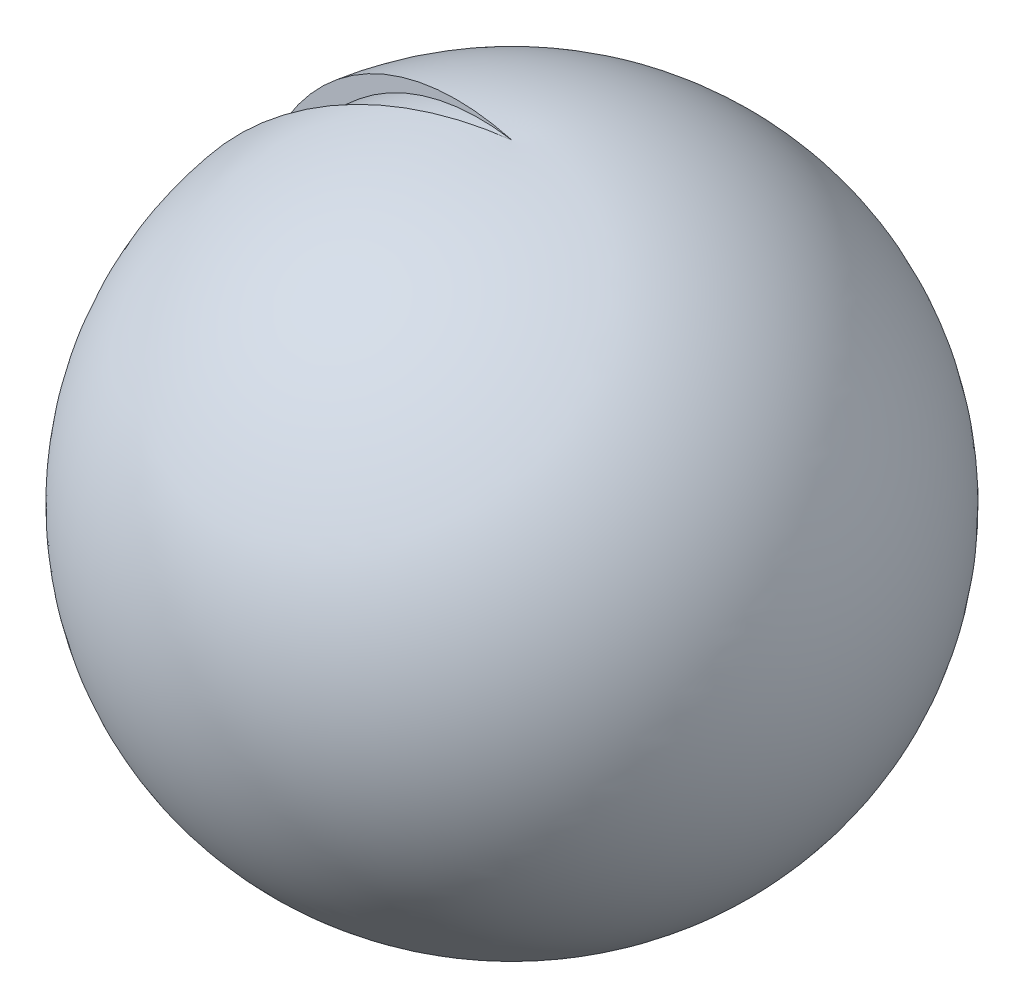
ISO-10303-21;
HEADER;
FILE_DESCRIPTION(('STEP AP214'),'2;1');
FILE_NAME('part.step','',(''),(''),'','','');
FILE_SCHEMA(('AUTOMOTIVE_DESIGN { 1 0 10303 214 1 1 1 1 }'));
ENDSEC;
DATA;
#1=APPLICATION_CONTEXT('core data for automotive mechanical design processes');
#2=APPLICATION_PROTOCOL_DEFINITION('international standard','automotive_design',2000,#1);
#3=PRODUCT_CONTEXT('',#1,'mechanical');
#4=PRODUCT('Part','Part','',(#3));
#5=PRODUCT_RELATED_PRODUCT_CATEGORY('part','',(#4));
#6=PRODUCT_DEFINITION_FORMATION('','',#4);
#7=PRODUCT_DEFINITION_CONTEXT('part definition',#1,'design');
#8=PRODUCT_DEFINITION('design','',#6,#7);
#9=PRODUCT_DEFINITION_SHAPE('','',#8);
#10=(LENGTH_UNIT() NAMED_UNIT(*) SI_UNIT(.MILLI.,.METRE.));
#11=(NAMED_UNIT(*) PLANE_ANGLE_UNIT() SI_UNIT($,.RADIAN.));
#12=(NAMED_UNIT(*) SI_UNIT($,.STERADIAN.) SOLID_ANGLE_UNIT());
#13=UNCERTAINTY_MEASURE_WITH_UNIT(LENGTH_MEASURE(1.E-05),#10,'distance_accuracy_value','');
#14=(GEOMETRIC_REPRESENTATION_CONTEXT(3) GLOBAL_UNCERTAINTY_ASSIGNED_CONTEXT((#13)) GLOBAL_UNIT_ASSIGNED_CONTEXT((#10,
#11,#12)) REPRESENTATION_CONTEXT('',''));
#15=CARTESIAN_POINT('',(0.,0.,0.));
#16=DIRECTION('',(0.,0.,1.));
#17=DIRECTION('',(1.,0.,0.));
#18=AXIS2_PLACEMENT_3D('',#15,#16,#17);
#19=CARTESIAN_POINT('',(0.,316.757357555114,40.001853342897));
#20=DIRECTION('',(-1.,0.,0.));
#21=DIRECTION('',(0.,0.,-1.));
#22=AXIS2_PLACEMENT_3D('',#19,#20,#21);
#23=CIRCLE('',#22,886.815172660816);
#24=TRIMMED_CURVE('',#23,(PARAMETER_VALUE(-1.52567369909589)),
(PARAMETER_VALUE(1.52567369909589)),.T.,.PARAMETER.);
#25=CARTESIAN_POINT('',(0.,316.757357555114,0.));
#26=DIRECTION('',(0.,-1.,0.));
#27=AXIS1_PLACEMENT('',#25,#26);
#28=SURFACE_OF_REVOLUTION('',#24,#27);
#29=CARTESIAN_POINT('',(0.,691.536604846044,0.));
#30=DIRECTION('',(0.,-1.,0.));
#31=DIRECTION('',(0.,0.,-1.));
#32=AXIS2_PLACEMENT_3D('',#29,#30,#31);
#33=CIRCLE('',#32,763.727993223396);
#34=CARTESIAN_POINT('',(-752.125248918855,691.536604846044,132.619974256465));
#35=VERTEX_POINT('',#34);
#36=CARTESIAN_POINT('',(-752.125248918855,691.536604846044,-132.619974256465));
#37=VERTEX_POINT('',#36);
#38=EDGE_CURVE('E12',#35,#37,#33,.T.);
#39=ORIENTED_EDGE('',*,*,#38,.F.);
#40=CARTESIAN_POINT('',(39.3941353069422,316.757357555114,-6.94624893629388));
#41=DIRECTION('',(0.173648177666931,0.,0.984807753012208));
#42=DIRECTION('',(0.984807753012208,0.,-0.173648177666931));
#43=AXIS2_PLACEMENT_3D('',#40,#41,#42);
#44=CIRCLE('',#43,886.815172660816);
#45=CARTESIAN_POINT('',(0.,1202.66988268983,0.));
#46=VERTEX_POINT('',#45);
#47=EDGE_CURVE('E98',#46,#35,#44,.T.);
#48=ORIENTED_EDGE('',*,*,#47,.F.);
#49=CARTESIAN_POINT('',(39.3941353069422,316.757357555114,6.94624893629388));
#50=DIRECTION('',(-0.173648177666931,0.,0.984807753012208));
#51=DIRECTION('',(0.984807753012208,0.,0.173648177666931));
#52=AXIS2_PLACEMENT_3D('',#49,#50,#51);
#53=CIRCLE('',#52,886.815172660816);
#54=EDGE_CURVE('E66',#46,#37,#53,.T.);
#55=ORIENTED_EDGE('',*,*,#54,.T.);
#56=EDGE_LOOP('',(#39,#48,#55));
#57=FACE_BOUND('',#56,.T.);
#58=ADVANCED_FACE('F51',(#57),#28,.T.);
#59=CARTESIAN_POINT('',(0.,504.820269803941,0.));
#60=DIRECTION('',(0.,-1.,0.));
#61=DIRECTION('',(0.,0.,-1.));
#62=AXIS2_PLACEMENT_3D('',#59,#60,#61);
#63=DEGENERATE_TOROIDAL_SURFACE('',#62,363.306965646286,441.814428349125,.T.);
#64=CARTESIAN_POINT('',(0.,69.4601548929694,0.));
#65=DIRECTION('',(0.,-1.,0.));
#66=DIRECTION('',(0.,0.,-1.));
#67=AXIS2_PLACEMENT_3D('',#64,#65,#66);
#68=CIRCLE('',#67,438.550300515028);
#69=CARTESIAN_POINT('',(-431.887736033033,69.4601548929694,76.1534604997194));
#70=VERTEX_POINT('',#69);
#71=CARTESIAN_POINT('',(-431.887736033033,69.4601548929694,-76.1534604997194));
#72=VERTEX_POINT('',#71);
#73=EDGE_CURVE('E59',#70,#72,#68,.T.);
#74=ORIENTED_EDGE('',*,*,#73,.F.);
#75=CARTESIAN_POINT('',(-357.787516491802,504.820269803941,63.0875925181797));
#76=DIRECTION('',(0.173648177666931,0.,0.984807753012208));
#77=DIRECTION('',(0.984807753012208,0.,-0.173648177666931));
#78=AXIS2_PLACEMENT_3D('',#75,#76,#77);
#79=CIRCLE('',#78,441.814428349125);
#80=EDGE_CURVE('E95',#35,#70,#79,.T.);
#81=ORIENTED_EDGE('',*,*,#80,.F.);
#82=ORIENTED_EDGE('',*,*,#38,.T.);
#83=CARTESIAN_POINT('',(-357.787516491802,504.820269803941,-63.0875925181797));
#84=DIRECTION('',(-0.173648177666931,0.,0.984807753012208));
#85=DIRECTION('',(0.984807753012208,0.,0.173648177666931));
#86=AXIS2_PLACEMENT_3D('',#83,#84,#85);
#87=CIRCLE('',#86,441.814428349125);
#88=EDGE_CURVE('E92',#37,#72,#87,.T.);
#89=ORIENTED_EDGE('',*,*,#88,.T.);
#90=EDGE_LOOP('',(#74,#81,#82,#89));
#91=FACE_BOUND('',#90,.T.);
#92=ADVANCED_FACE('F53',(#91),#63,.T.);
#93=CARTESIAN_POINT('',(0.,316.755144769097,0.));
#94=DIRECTION('',(0.,-1.,0.));
#95=DIRECTION('',(0.,0.,-1.));
#96=AXIS2_PLACEMENT_3D('',#93,#94,#95);
#97=DEGENERATE_TOROIDAL_SURFACE('',#96,40.0000005549732,538.669845705161,.F.);
#98=CARTESIAN_POINT('',(0.,842.30410325337,0.));
#99=DIRECTION('',(0.,-1.,0.));
#100=DIRECTION('',(0.,0.,-1.));
#101=AXIS2_PLACEMENT_3D('',#98,#99,#100);
#102=CIRCLE('',#101,78.167232247179);
#103=CARTESIAN_POINT('',(-76.9796963485277,842.30410325337,13.5735974329904));
#104=VERTEX_POINT('',#103);
#105=CARTESIAN_POINT('',(-76.9796963485277,842.30410325337,-13.5735974329904));
#106=VERTEX_POINT('',#105);
#107=EDGE_CURVE('E117',#104,#106,#102,.T.);
#108=ORIENTED_EDGE('',*,*,#107,.F.);
#109=CARTESIAN_POINT('',(39.3923106670302,316.755144769097,-6.94592720304732));
#110=DIRECTION('',(-0.173648177666931,0.,-0.984807753012208));
#111=DIRECTION('',(0.984807753012208,0.,-0.173648177666931));
#112=AXIS2_PLACEMENT_3D('',#109,#110,#111);
#113=CIRCLE('',#112,538.669845705161);
#114=EDGE_CURVE('E110',#70,#104,#113,.T.);
#115=ORIENTED_EDGE('',*,*,#114,.F.);
#116=ORIENTED_EDGE('',*,*,#73,.T.);
#117=CARTESIAN_POINT('',(39.3923106670303,316.755144769097,6.94592720304732));
#118=DIRECTION('',(0.173648177666931,0.,-0.984807753012208));
#119=DIRECTION('',(0.984807753012208,0.,0.173648177666931));
#120=AXIS2_PLACEMENT_3D('',#117,#118,#119);
#121=CIRCLE('',#120,538.669845705161);
#122=EDGE_CURVE('E102',#72,#106,#121,.T.);
#123=ORIENTED_EDGE('',*,*,#122,.T.);
#124=EDGE_LOOP('',(#108,#115,#116,#123));
#125=FACE_BOUND('',#124,.T.);
#126=ADVANCED_FACE('F120',(#125),#97,.T.);
#127=CARTESIAN_POINT('',(0.,504.82028321714,-363.306952930245));
#128=DIRECTION('',(-1.,0.,0.));
#129=DIRECTION('',(0.,0.,-1.));
#130=AXIS2_PLACEMENT_3D('',#127,#128,#129);
#131=CIRCLE('',#130,441.814428349125);
#132=TRIMMED_CURVE('',#131,(PARAMETER_VALUE(-2.53624914352901)),
(PARAMETER_VALUE(2.53624914352901)),.T.,.PARAMETER.);
#133=CARTESIAN_POINT('',(0.,504.82028321714,0.));
#134=DIRECTION('',(0.,-1.,0.));
#135=AXIS1_PLACEMENT('',#133,#134);
#136=SURFACE_OF_REVOLUTION('',#132,#135);
#137=CARTESIAN_POINT('',(-357.787503968946,504.82028321714,-63.0875903100624));
#138=DIRECTION('',(0.173648177666931,0.,-0.984807753012208));
#139=DIRECTION('',(0.984807753012208,0.,0.173648177666931));
#140=AXIS2_PLACEMENT_3D('',#137,#138,#139);
#141=CIRCLE('',#140,441.814428349125);
#142=CARTESIAN_POINT('',(0.,756.232389230364,0.));
#143=VERTEX_POINT('',#142);
#144=EDGE_CURVE('E104',#106,#143,#141,.T.);
#145=ORIENTED_EDGE('',*,*,#144,.T.);
#146=CARTESIAN_POINT('',(-357.787503968946,504.82028321714,63.0875903100624));
#147=DIRECTION('',(-0.173648177666931,0.,-0.984807753012208));
#148=DIRECTION('',(0.984807753012208,0.,-0.173648177666931));
#149=AXIS2_PLACEMENT_3D('',#146,#147,#148);
#150=CIRCLE('',#149,441.814428349125);
#151=EDGE_CURVE('E113',#104,#143,#150,.T.);
#152=ORIENTED_EDGE('',*,*,#151,.F.);
#153=ORIENTED_EDGE('',*,*,#107,.T.);
#154=EDGE_LOOP('',(#145,#152,#153));
#155=FACE_BOUND('',#154,.T.);
#156=ADVANCED_FACE('F125',(#155),#136,.F.);
#157=CARTESIAN_POINT('',(39.3941353069422,316.757357555114,-6.94624893629388));
#158=DIRECTION('',(0.173648177666931,0.,0.984807753012208));
#159=DIRECTION('',(0.984807753012208,0.,-0.173648177666931));
#160=AXIS2_PLACEMENT_3D('',#157,#158,#159);
#161=PLANE('',#160);
#162=ORIENTED_EDGE('',*,*,#47,.T.);
#163=ORIENTED_EDGE('',*,*,#80,.T.);
#164=ORIENTED_EDGE('',*,*,#114,.T.);
#165=ORIENTED_EDGE('',*,*,#151,.T.);
#166=DIRECTION('',(0.,1.,0.));
#167=VECTOR('',#166,1.);
#168=CARTESIAN_POINT('',(0.,756.232389230364,0.));
#169=LINE('',#168,#167);
#170=EDGE_CURVE('E71',#143,#46,#169,.T.);
#171=ORIENTED_EDGE('',*,*,#170,.T.);
#172=EDGE_LOOP('',(#162,#163,#164,#165,#171));
#173=FACE_BOUND('',#172,.T.);
#174=ADVANCED_FACE('F122',(#173),#161,.T.);
#175=CARTESIAN_POINT('',(39.3941353069422,316.757357555114,6.94624893629388));
#176=DIRECTION('',(-0.173648177666931,0.,0.984807753012208));
#177=DIRECTION('',(0.984807753012208,0.,0.173648177666931));
#178=AXIS2_PLACEMENT_3D('',#175,#176,#177);
#179=PLANE('',#178);
#180=ORIENTED_EDGE('',*,*,#54,.F.);
#181=ORIENTED_EDGE('',*,*,#170,.F.);
#182=ORIENTED_EDGE('',*,*,#144,.F.);
#183=ORIENTED_EDGE('',*,*,#122,.F.);
#184=ORIENTED_EDGE('',*,*,#88,.F.);
#185=EDGE_LOOP('',(#180,#181,#182,#183,#184));
#186=FACE_BOUND('',#185,.T.);
#187=ADVANCED_FACE('F100',(#186),#179,.F.);
#188=CLOSED_SHELL('',(#58,#92,#126,#156,#174,#187));
#189=MANIFOLD_SOLID_BREP('B2',#188);
#190=CARTESIAN_POINT('',(0.,-47.7675103642231,0.));
#191=DIRECTION('',(0.,-1.,0.));
#192=DIRECTION('',(0.,0.,-1.));
#193=AXIS2_PLACEMENT_3D('',#190,#191,#192);
#194=DEGENERATE_TOROIDAL_SURFACE('',#193,295.241511527549,441.814428349125,.T.);
#195=CARTESIAN_POINT('',(0.,-409.680702542864,0.));
#196=DIRECTION('',(0.,-1.,0.));
#197=DIRECTION('',(0.,0.,-1.));
#198=AXIS2_PLACEMENT_3D('',#195,#196,#197);
#199=CIRCLE('',#198,548.655856868395);
#200=CARTESIAN_POINT('',(-540.320541579552,-409.680702542864,-95.2730897114816));
#201=VERTEX_POINT('',#200);
#202=CARTESIAN_POINT('',(-540.320541579552,-409.680702542864,95.2730897114816));
#203=VERTEX_POINT('',#202);
#204=EDGE_CURVE('E49',#201,#203,#199,.T.);
#205=ORIENTED_EDGE('',*,*,#204,.T.);
#206=CARTESIAN_POINT('',(-290.756129563374,-47.7675103642231,51.2681504483871));
#207=DIRECTION('',(-0.173648177666924,0.,-0.984807753012209));
#208=DIRECTION('',(-0.984807753012209,0.,0.173648177666924));
#209=AXIS2_PLACEMENT_3D('',#206,#207,#208);
#210=CIRCLE('',#209,441.814428349125);
#211=CARTESIAN_POINT('',(-138.409002396809,-461.613769335048,24.4052414954991));
#212=VERTEX_POINT('',#211);
#213=EDGE_CURVE('E221',#212,#203,#210,.T.);
#214=ORIENTED_EDGE('',*,*,#213,.F.);
#215=CARTESIAN_POINT('',(0.,-461.613769335048,0.));
#216=DIRECTION('',(0.,-1.,0.));
#217=DIRECTION('',(0.,0.,-1.));
#218=AXIS2_PLACEMENT_3D('',#215,#216,#217);
#219=CIRCLE('',#218,140.544184358278);
#220=CARTESIAN_POINT('',(-138.409002396809,-461.613769335048,-24.4052414954991));
#221=VERTEX_POINT('',#220);
#222=EDGE_CURVE('E190',#221,#212,#219,.T.);
#223=ORIENTED_EDGE('',*,*,#222,.F.);
#224=CARTESIAN_POINT('',(-290.756129563374,-47.7675103642231,-51.2681504483871));
#225=DIRECTION('',(0.173648177666924,0.,-0.984807753012209));
#226=DIRECTION('',(-0.984807753012209,0.,-0.173648177666924));
#227=AXIS2_PLACEMENT_3D('',#224,#225,#226);
#228=CIRCLE('',#227,441.814428349125);
#229=EDGE_CURVE('E223',#221,#201,#228,.T.);
#230=ORIENTED_EDGE('',*,*,#229,.T.);
#231=EDGE_LOOP('',(#205,#214,#223,#230));
#232=FACE_BOUND('',#231,.T.);
#233=ADVANCED_FACE('F175',(#232),#194,.T.);
#234=CARTESIAN_POINT('',(0.,316.757357555114,-40.001853342897));
#235=DIRECTION('',(-1.,0.,0.));
#236=DIRECTION('',(0.,0.,-1.));
#237=AXIS2_PLACEMENT_3D('',#234,#235,#236);
#238=CIRCLE('',#237,886.815172660816);
#239=TRIMMED_CURVE('',#238,(PARAMETER_VALUE(-1.61591895449391)),
(PARAMETER_VALUE(1.61591895449391)),.T.,.PARAMETER.);
#240=CARTESIAN_POINT('',(0.,316.757357555114,0.));
#241=DIRECTION('',(0.,-1.,0.));
#242=AXIS1_PLACEMENT('',#240,#241);
#243=SURFACE_OF_REVOLUTION('',#239,#242);
#244=CARTESIAN_POINT('',(-39.3941353069423,316.757357555114,6.94624893629362));
#245=DIRECTION('',(-0.173648177666924,0.,-0.984807753012209));
#246=DIRECTION('',(-0.984807753012209,0.,0.173648177666924));
#247=AXIS2_PLACEMENT_3D('',#244,#245,#246);
#248=CIRCLE('',#247,886.815172660816);
#249=CARTESIAN_POINT('',(0.,1202.66988268983,0.));
#250=VERTEX_POINT('',#249);
#251=EDGE_CURVE('E232',#203,#250,#248,.T.);
#252=ORIENTED_EDGE('',*,*,#251,.F.);
#253=ORIENTED_EDGE('',*,*,#204,.F.);
#254=CARTESIAN_POINT('',(-39.3941353069423,316.757357555114,-6.94624893629362));
#255=DIRECTION('',(0.173648177666924,0.,-0.984807753012209));
#256=DIRECTION('',(-0.984807753012209,0.,-0.173648177666924));
#257=AXIS2_PLACEMENT_3D('',#254,#255,#256);
#258=CIRCLE('',#257,886.815172660816);
#259=EDGE_CURVE('E236',#201,#250,#258,.T.);
#260=ORIENTED_EDGE('',*,*,#259,.T.);
#261=EDGE_LOOP('',(#252,#253,#260));
#262=FACE_BOUND('',#261,.T.);
#263=ADVANCED_FACE('F177',(#262),#243,.T.);
#264=CARTESIAN_POINT('',(0.,504.82028321714,363.306952930245));
#265=DIRECTION('',(-1.,0.,0.));
#266=DIRECTION('',(0.,0.,-1.));
#267=AXIS2_PLACEMENT_3D('',#264,#265,#266);
#268=CIRCLE('',#267,441.814428349125);
#269=TRIMMED_CURVE('',#268,(PARAMETER_VALUE(-0.60534351006078)),
(PARAMETER_VALUE(0.60534351006078)),.T.,.PARAMETER.);
#270=CARTESIAN_POINT('',(0.,504.82028321714,0.));
#271=DIRECTION('',(0.,-1.,0.));
#272=AXIS1_PLACEMENT('',#270,#271);
#273=SURFACE_OF_REVOLUTION('',#269,#272);
#274=CARTESIAN_POINT('',(0.,506.319533319672,0.));
#275=DIRECTION('',(0.,-1.,0.));
#276=DIRECTION('',(0.,0.,-1.));
#277=AXIS2_PLACEMENT_3D('',#274,#275,#276);
#278=CIRCLE('',#277,78.5049316389618);
#279=CARTESIAN_POINT('',(-77.312265327743,506.319533319672,-13.6322383169722));
#280=VERTEX_POINT('',#279);
#281=CARTESIAN_POINT('',(-77.312265327743,506.319533319672,13.6322383169722));
#282=VERTEX_POINT('',#281);
#283=EDGE_CURVE('E183',#280,#282,#278,.T.);
#284=ORIENTED_EDGE('',*,*,#283,.T.);
#285=CARTESIAN_POINT('',(357.787503968947,504.82028321714,-63.08759031006));
#286=DIRECTION('',(0.173648177666924,0.,0.984807753012209));
#287=DIRECTION('',(-0.984807753012209,0.,0.173648177666924));
#288=AXIS2_PLACEMENT_3D('',#285,#286,#287);
#289=CIRCLE('',#288,441.814428349125);
#290=CARTESIAN_POINT('',(0.,756.232389230364,0.));
#291=VERTEX_POINT('',#290);
#292=EDGE_CURVE('E237',#291,#282,#289,.T.);
#293=ORIENTED_EDGE('',*,*,#292,.F.);
#294=CARTESIAN_POINT('',(357.787503968947,504.82028321714,63.08759031006));
#295=DIRECTION('',(-0.173648177666924,0.,0.984807753012209));
#296=DIRECTION('',(-0.984807753012209,0.,-0.173648177666924));
#297=AXIS2_PLACEMENT_3D('',#294,#295,#296);
#298=CIRCLE('',#297,441.814428349125);
#299=EDGE_CURVE('E249',#291,#280,#298,.T.);
#300=ORIENTED_EDGE('',*,*,#299,.T.);
#301=EDGE_LOOP('',(#284,#293,#300));
#302=FACE_BOUND('',#301,.T.);
#303=ADVANCED_FACE('F259',(#302),#273,.F.);
#304=CARTESIAN_POINT('',(0.,316.755144769097,0.));
#305=DIRECTION('',(0.,-1.,0.));
#306=DIRECTION('',(0.,0.,-1.));
#307=AXIS2_PLACEMENT_3D('',#304,#305,#306);
#308=DEGENERATE_TOROIDAL_SURFACE('',#307,40.0000005549732,193.435485690542,.T.);
#309=CARTESIAN_POINT('',(0.,151.503354377394,0.));
#310=DIRECTION('',(0.,-1.,0.));
#311=DIRECTION('',(0.,0.,-1.));
#312=AXIS2_PLACEMENT_3D('',#309,#310,#311);
#313=CIRCLE('',#312,140.544184358278);
#314=CARTESIAN_POINT('',(-138.409002396809,151.503354377394,-24.4052414954991));
#315=VERTEX_POINT('',#314);
#316=CARTESIAN_POINT('',(-138.409002396809,151.503354377394,24.4052414954991));
#317=VERTEX_POINT('',#316);
#318=EDGE_CURVE('E198',#315,#317,#313,.T.);
#319=ORIENTED_EDGE('',*,*,#318,.T.);
#320=CARTESIAN_POINT('',(-39.3923106670303,316.755144769097,6.94592720304705));
#321=DIRECTION('',(0.173648177666924,0.,0.984807753012209));
#322=DIRECTION('',(-0.984807753012209,0.,0.173648177666924));
#323=AXIS2_PLACEMENT_3D('',#320,#321,#322);
#324=CIRCLE('',#323,193.435485690542);
#325=EDGE_CURVE('E240',#282,#317,#324,.T.);
#326=ORIENTED_EDGE('',*,*,#325,.F.);
#327=ORIENTED_EDGE('',*,*,#283,.F.);
#328=CARTESIAN_POINT('',(-39.3923106670303,316.755144769097,-6.94592720304705));
#329=DIRECTION('',(-0.173648177666924,0.,0.984807753012209));
#330=DIRECTION('',(-0.984807753012209,0.,-0.173648177666924));
#331=AXIS2_PLACEMENT_3D('',#328,#329,#330);
#332=CIRCLE('',#331,193.435485690542);
#333=EDGE_CURVE('E252',#280,#315,#332,.T.);
#334=ORIENTED_EDGE('',*,*,#333,.T.);
#335=EDGE_LOOP('',(#319,#326,#327,#334));
#336=FACE_BOUND('',#335,.T.);
#337=ADVANCED_FACE('F264',(#336),#308,.F.);
#338=CARTESIAN_POINT('',(0.,756.232389230364,0.));
#339=DIRECTION('',(0.,-1.,0.));
#340=DIRECTION('',(0.,0.,-1.));
#341=AXIS2_PLACEMENT_3D('',#338,#339,#340);
#342=CYLINDRICAL_SURFACE('',#341,140.544184358278);
#343=DIRECTION('',(0.,-1.,0.));
#344=VECTOR('',#343,1.);
#345=CARTESIAN_POINT('',(-138.409002396809,151.503354377394,-24.4052414954991));
#346=LINE('',#345,#344);
#347=EDGE_CURVE('E254',#315,#221,#346,.T.);
#348=ORIENTED_EDGE('',*,*,#347,.T.);
#349=ORIENTED_EDGE('',*,*,#222,.T.);
#350=DIRECTION('',(0.,-1.,0.));
#351=VECTOR('',#350,1.);
#352=CARTESIAN_POINT('',(-138.409002396809,151.503354377394,24.4052414954991));
#353=LINE('',#352,#351);
#354=EDGE_CURVE('E234',#317,#212,#353,.T.);
#355=ORIENTED_EDGE('',*,*,#354,.F.);
#356=ORIENTED_EDGE('',*,*,#318,.F.);
#357=EDGE_LOOP('',(#348,#349,#355,#356));
#358=FACE_BOUND('',#357,.T.);
#359=ADVANCED_FACE('F268',(#358),#342,.F.);
#360=CARTESIAN_POINT('',(-290.756129563374,-47.7675103642231,-51.2681504483871));
#361=DIRECTION('',(0.173648177666924,0.,-0.984807753012209));
#362=DIRECTION('',(-0.984807753012209,0.,-0.173648177666924));
#363=AXIS2_PLACEMENT_3D('',#360,#361,#362);
#364=PLANE('',#363);
#365=ORIENTED_EDGE('',*,*,#229,.F.);
#366=ORIENTED_EDGE('',*,*,#347,.F.);
#367=ORIENTED_EDGE('',*,*,#333,.F.);
#368=ORIENTED_EDGE('',*,*,#299,.F.);
#369=DIRECTION('',(0.,-1.,0.));
#370=VECTOR('',#369,1.);
#371=CARTESIAN_POINT('',(0.,756.232389230364,0.));
#372=LINE('',#371,#370);
#373=EDGE_CURVE('E247',#250,#291,#372,.T.);
#374=ORIENTED_EDGE('',*,*,#373,.F.);
#375=ORIENTED_EDGE('',*,*,#259,.F.);
#376=EDGE_LOOP('',(#365,#366,#367,#368,#374,#375));
#377=FACE_BOUND('',#376,.T.);
#378=ADVANCED_FACE('F267',(#377),#364,.F.);
#379=CARTESIAN_POINT('',(-290.756129563374,-47.7675103642231,51.2681504483871));
#380=DIRECTION('',(-0.173648177666924,0.,-0.984807753012209));
#381=DIRECTION('',(-0.984807753012209,0.,0.173648177666924));
#382=AXIS2_PLACEMENT_3D('',#379,#380,#381);
#383=PLANE('',#382);
#384=ORIENTED_EDGE('',*,*,#213,.T.);
#385=ORIENTED_EDGE('',*,*,#251,.T.);
#386=ORIENTED_EDGE('',*,*,#373,.T.);
#387=ORIENTED_EDGE('',*,*,#292,.T.);
#388=ORIENTED_EDGE('',*,*,#325,.T.);
#389=ORIENTED_EDGE('',*,*,#354,.T.);
#390=EDGE_LOOP('',(#384,#385,#386,#387,#388,#389));
#391=FACE_BOUND('',#390,.T.);
#392=ADVANCED_FACE('F230',(#391),#383,.T.);
#393=CLOSED_SHELL('',(#233,#263,#303,#337,#359,#378,#392));
#394=MANIFOLD_SOLID_BREP('B6',#393);
#395=ADVANCED_BREP_SHAPE_REPRESENTATION('',(#18,#189,#394),#14);
#396=SHAPE_DEFINITION_REPRESENTATION(#9,#395);
ENDSEC;
END-ISO-10303-21;
